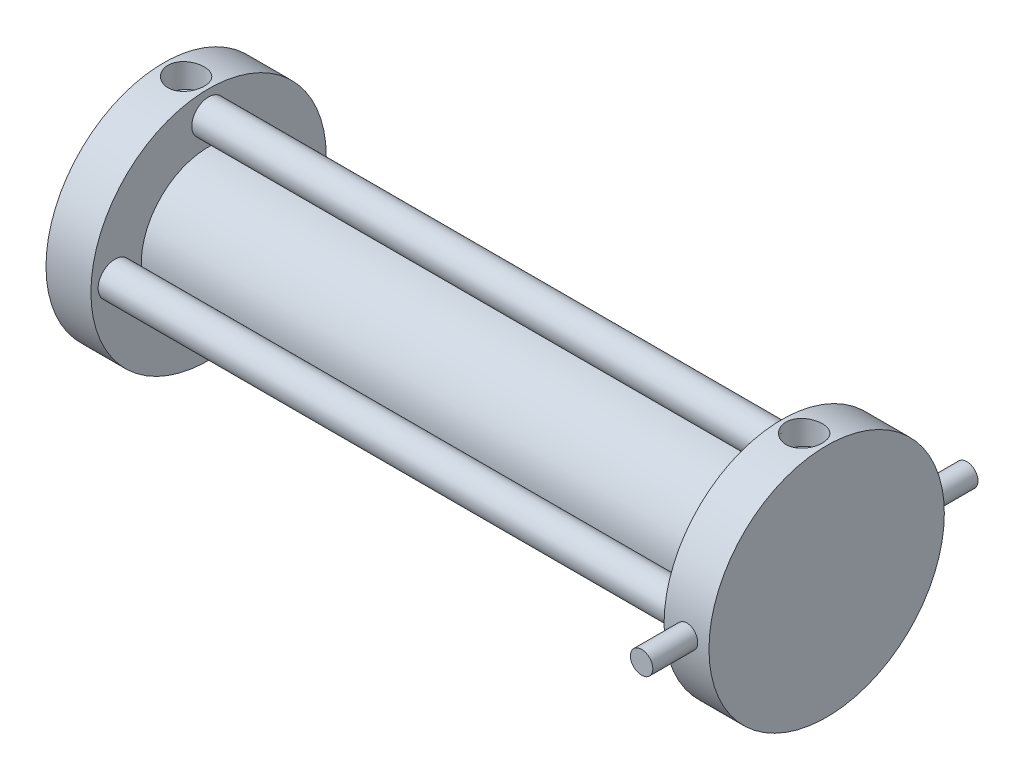
ISO-10303-21;
HEADER;
FILE_DESCRIPTION(('STEP AP214'),'2;1');
FILE_NAME('part.step','',(''),(''),'','','');
FILE_SCHEMA(('AUTOMOTIVE_DESIGN { 1 0 10303 214 1 1 1 1 }'));
ENDSEC;
DATA;
#1=APPLICATION_CONTEXT('core data for automotive mechanical design processes');
#2=APPLICATION_PROTOCOL_DEFINITION('international standard','automotive_design',2000,#1);
#3=PRODUCT_CONTEXT('',#1,'mechanical');
#4=PRODUCT('Part','Part','',(#3));
#5=PRODUCT_RELATED_PRODUCT_CATEGORY('part','',(#4));
#6=PRODUCT_DEFINITION_FORMATION('','',#4);
#7=PRODUCT_DEFINITION_CONTEXT('part definition',#1,'design');
#8=PRODUCT_DEFINITION('design','',#6,#7);
#9=PRODUCT_DEFINITION_SHAPE('','',#8);
#10=(LENGTH_UNIT() NAMED_UNIT(*) SI_UNIT(.MILLI.,.METRE.));
#11=(NAMED_UNIT(*) PLANE_ANGLE_UNIT() SI_UNIT($,.RADIAN.));
#12=(NAMED_UNIT(*) SI_UNIT($,.STERADIAN.) SOLID_ANGLE_UNIT());
#13=UNCERTAINTY_MEASURE_WITH_UNIT(LENGTH_MEASURE(1.E-05),#10,'distance_accuracy_value','');
#14=(GEOMETRIC_REPRESENTATION_CONTEXT(3) GLOBAL_UNCERTAINTY_ASSIGNED_CONTEXT((#13)) GLOBAL_UNIT_ASSIGNED_CONTEXT((#10,
#11,#12)) REPRESENTATION_CONTEXT('',''));
#15=CARTESIAN_POINT('',(0.,0.,0.));
#16=DIRECTION('',(0.,0.,1.));
#17=DIRECTION('',(1.,0.,0.));
#18=AXIS2_PLACEMENT_3D('',#15,#16,#17);
#19=CARTESIAN_POINT('',(187.452,0.,0.));
#20=DIRECTION('',(-1.,0.,0.));
#21=DIRECTION('',(0.,0.,1.));
#22=AXIS2_PLACEMENT_3D('',#19,#20,#21);
#23=CYLINDRICAL_SURFACE('',#22,33.274);
#24=CARTESIAN_POINT('',(177.563200178994,33.0652566163438,-3.72127409570066));
#25=CARTESIAN_POINT('',(177.772629469487,33.0429482318039,-3.91949732838269));
#26=CARTESIAN_POINT('',(177.998915602869,33.0208072454176,-4.1001718860428));
#27=CARTESIAN_POINT('',(178.478907105523,32.9793565679599,-4.42125292931893));
#28=CARTESIAN_POINT('',(178.732638283215,32.9600495828081,-4.56162105081854));
#29=CARTESIAN_POINT('',(179.260345097927,32.9264818691753,-4.79793434583255));
#30=CARTESIAN_POINT('',(179.534320128977,32.9122209897206,-4.8938808484182));
#31=CARTESIAN_POINT('',(180.094669829727,32.8903975618722,-5.03847515472606));
#32=CARTESIAN_POINT('',(180.381041304099,32.8828332980045,-5.08713507217993));
#33=CARTESIAN_POINT('',(180.956033608298,32.8753054758383,-5.13555972281086));
#34=CARTESIAN_POINT('',(181.244626104385,32.875290831484,-5.13565309158396));
#35=CARTESIAN_POINT('',(181.817698727291,32.8827356794035,-5.08776383433134));
#36=CARTESIAN_POINT('',(182.102178787033,32.8901952934502,-5.03978042502448));
#37=CARTESIAN_POINT('',(182.657916967103,32.9116892350749,-4.8974373434176));
#38=CARTESIAN_POINT('',(182.929219075785,32.9256997517771,-4.80324556634604));
#39=CARTESIAN_POINT('',(183.452183041596,32.9587017661262,-4.5712912597611));
#40=CARTESIAN_POINT('',(183.703843878541,32.9776935222801,-4.43352646890016));
#41=CARTESIAN_POINT('',(184.182508386549,33.0186999957293,-4.11704934659531));
#42=CARTESIAN_POINT('',(184.40930535564,33.0407370474255,-3.93802727557339));
#43=CARTESIAN_POINT('',(184.829733127168,33.0852556517351,-3.54457879361774));
#44=CARTESIAN_POINT('',(185.023362507949,33.1077372233558,-3.33015086586322));
#45=CARTESIAN_POINT('',(185.373067349896,33.1507681573595,-2.87039502918819));
#46=CARTESIAN_POINT('',(185.52891626289,33.1713054341931,-2.62489352876049));
#47=CARTESIAN_POINT('',(185.797027102362,33.2079771702855,-2.11083713814493));
#48=CARTESIAN_POINT('',(185.90929118331,33.2241118471604,-1.84228338826944));
#49=CARTESIAN_POINT('',(186.086180866149,33.2500472787563,-1.29179979636255));
#50=CARTESIAN_POINT('',(186.151149812872,33.259893618967,-1.00998250043332));
#51=CARTESIAN_POINT('',(186.23276982711,33.2723235697957,-0.439286266318469));
#52=CARTESIAN_POINT('',(186.249424665865,33.2749077472736,-0.150407881073319));
#53=CARTESIAN_POINT('',(186.233990471097,33.2725351781281,0.422720472249694));
#54=CARTESIAN_POINT('',(186.202451673477,33.2676635548133,0.70698579309776));
#55=CARTESIAN_POINT('',(186.092618586443,33.2510793359444,1.26612044808062));
#56=CARTESIAN_POINT('',(186.014324151405,33.2393667190834,1.5409897529479));
#57=CARTESIAN_POINT('',(185.813264347636,33.2103841321508,2.07382918189039));
#58=CARTESIAN_POINT('',(185.690469522959,33.1931104819364,2.33178797859826));
#59=CARTESIAN_POINT('',(185.403966706969,33.1548993703004,2.82358714670083));
#60=CARTESIAN_POINT('',(185.24025575415,33.1339616437059,3.05742577054721));
#61=CARTESIAN_POINT('',(184.874345147627,33.0904463358323,3.49727485660346));
#62=CARTESIAN_POINT('',(184.671718225071,33.0678524556106,3.70292833255674));
#63=CARTESIAN_POINT('',(184.234862704382,33.023757301146,4.07752305639828));
#64=CARTESIAN_POINT('',(184.00063275849,33.0022560735549,4.24646273776794));
#65=CARTESIAN_POINT('',(183.505402878859,32.9626269090273,4.54390239641229));
#66=CARTESIAN_POINT('',(183.244239137354,32.9445217605824,4.6721329186286));
#67=CARTESIAN_POINT('',(182.703778435218,32.9139422571387,4.88291921877905));
#68=CARTESIAN_POINT('',(182.424482385617,32.9014676194936,4.96547728947409));
#69=CARTESIAN_POINT('',(181.857610880513,32.8836609843559,5.08206759480338));
#70=CARTESIAN_POINT('',(181.570101080881,32.8782830636215,5.11641191655742));
#71=CARTESIAN_POINT('',(180.993352723585,32.8751454468966,5.13653611388134));
#72=CARTESIAN_POINT('',(180.704114246809,32.8773853971928,5.12231824429263));
#73=CARTESIAN_POINT('',(180.13430669021,32.8891781938294,5.04603550934228));
#74=CARTESIAN_POINT('',(179.853690199183,32.8986782945657,4.98431572654214));
#75=CARTESIAN_POINT('',(179.30684240825,32.9238436536572,4.81527143303873));
#76=CARTESIAN_POINT('',(179.040611581966,32.939509114855,4.70794542186506));
#77=CARTESIAN_POINT('',(178.528736902567,32.9753220310975,4.45018422472754));
#78=CARTESIAN_POINT('',(178.283190928272,32.9954893088488,4.29955750275382));
#79=CARTESIAN_POINT('',(177.820749188612,33.0380078983485,3.95959200744943));
#80=CARTESIAN_POINT('',(177.603855213005,33.0603593463803,3.7702508176859));
#81=CARTESIAN_POINT('',(177.202960569154,33.1049585080353,3.35625033672982));
#82=CARTESIAN_POINT('',(177.019256928372,33.127203701656,3.13130297476403));
#83=CARTESIAN_POINT('',(176.692275961426,33.1688934546782,2.65348793488495));
#84=CARTESIAN_POINT('',(176.54899806619,33.1883380535016,2.40062065006977));
#85=CARTESIAN_POINT('',(176.307401371888,33.2221860795681,1.87472603151846));
#86=CARTESIAN_POINT('',(176.208965995096,33.2366025553304,1.6017531403506));
#87=CARTESIAN_POINT('',(176.059520131785,33.2588277114233,1.04287493755571));
#88=CARTESIAN_POINT('',(176.008504259815,33.2666371421098,0.756971098370351));
#89=CARTESIAN_POINT('',(175.955804800355,33.2747094724556,0.18404259978819));
#90=CARTESIAN_POINT('',(175.953532437448,33.2750624383546,-0.102926751439129));
#91=CARTESIAN_POINT('',(175.996896329944,33.2684117092695,-0.673186878491167));
#92=CARTESIAN_POINT('',(176.042540208955,33.2614068436336,-0.956477061689066));
#93=CARTESIAN_POINT('',(176.180027131985,33.2408682571658,-1.51004094950111));
#94=CARTESIAN_POINT('',(176.271672313133,33.2273625083538,-1.78036501472752));
#95=CARTESIAN_POINT('',(176.498304857338,33.1953247221461,-2.30165963010028));
#96=CARTESIAN_POINT('',(176.633254722171,33.1767970354753,-2.55264669214384));
#97=CARTESIAN_POINT('',(176.898173250334,33.1424893757649,-2.96034759194169));
#98=CARTESIAN_POINT('',(177.018505062127,33.1274415606746,-3.12347803861945));
#99=CARTESIAN_POINT('',(177.27752313852,33.0966538901068,-3.43437875792502));
#100=CARTESIAN_POINT('',(177.416209732627,33.0809140222087,-3.58214875471523));
#101=CARTESIAN_POINT('',(177.563200178994,33.0652566163438,-3.72127409570066));
#102=B_SPLINE_CURVE_WITH_KNOTS('',3,(#24,#25,#26,#27,#28,#29,#30,#31,#32,#33,#34,#35,#36,#37,
#38,#39,#40,#41,#42,#43,#44,#45,#46,#47,#48,#49,#50,#51,#52,#53,#54,#55,#56,#57,#58,#59,#60,#61,
#62,#63,#64,#65,#66,#67,#68,#69,#70,#71,#72,#73,#74,#75,#76,#77,#78,#79,#80,#81,#82,#83,#84,#85,
#86,#87,#88,#89,#90,#91,#92,#93,#94,#95,#96,#97,#98,#99,#100,#101),.UNSPECIFIED.,.T.,.F.,(4,2,2,
2,2,2,2,2,2,2,2,2,2,2,2,2,2,2,2,2,2,2,2,2,2,2,2,2,2,2,2,2,2,2,2,2,2,2,4),(0.,0.866942832459273,
1.7347081161559,2.60244743509756,3.46996440060784,4.33161105626584,5.19327175035527,
6.05182458624455,6.91042198652903,7.77568835329061,8.6409917985141,9.51136229422175,
10.3816897605957,11.2456341954478,12.1095111918348,12.9635985722587,13.8176886128253,
14.6723450331543,15.5270633313925,16.3917660873086,17.2565057314606,18.1268552158963,
18.9971610047493,19.861806921654,20.7264126918345,21.5847960509608,22.4432076535664,
23.3054763659793,24.1677989148768,25.0374927711507,25.9071743841445,26.7745819871183,
27.6418910662064,28.4987178949009,29.3556810678069,30.2089894186347,31.0615608609272,
31.6700241072523,32.2784982782605),.UNSPECIFIED.);
#103=CARTESIAN_POINT('',(177.563200178994,33.0652566163438,-3.72127409570066));
#104=VERTEX_POINT('',#103);
#105=EDGE_CURVE('E11',#104,#104,#102,.T.);
#106=ORIENTED_EDGE('',*,*,#105,.T.);
#107=EDGE_LOOP('',(#106));
#108=FACE_BOUND('',#107,.T.);
#109=CARTESIAN_POINT('',(187.452,0.,0.));
#110=DIRECTION('',(1.,0.,0.));
#111=DIRECTION('',(0.,0.,-1.));
#112=AXIS2_PLACEMENT_3D('',#109,#110,#111);
#113=CIRCLE('',#112,33.274);
#114=CARTESIAN_POINT('',(187.452,0.,-33.274));
#115=VERTEX_POINT('',#114);
#116=EDGE_CURVE('E85',#115,#115,#113,.T.);
#117=ORIENTED_EDGE('',*,*,#116,.F.);
#118=EDGE_LOOP('',(#117));
#119=FACE_BOUND('',#118,.T.);
#120=CARTESIAN_POINT('',(174.752,0.,0.));
#121=DIRECTION('',(1.,0.,0.));
#122=DIRECTION('',(0.,0.,-1.));
#123=AXIS2_PLACEMENT_3D('',#120,#121,#122);
#124=CIRCLE('',#123,33.274);
#125=CARTESIAN_POINT('',(174.752,0.,-33.274));
#126=VERTEX_POINT('',#125);
#127=EDGE_CURVE('E89',#126,#126,#124,.T.);
#128=ORIENTED_EDGE('',*,*,#127,.T.);
#129=EDGE_LOOP('',(#128));
#130=FACE_BOUND('',#129,.T.);
#131=CARTESIAN_POINT('',(184.277,0.,-33.274));
#132=CARTESIAN_POINT('',(184.276992275536,-0.177907124340107,-33.2739980372501));
#133=CARTESIAN_POINT('',(184.261996466603,-0.355932894286446,-33.2725579918988));
#134=CARTESIAN_POINT('',(184.202399981999,-0.707051780438678,-33.2669518332966));
#135=CARTESIAN_POINT('',(184.157766419394,-0.88013919412405,-33.2627826918324));
#136=CARTESIAN_POINT('',(184.04020306018,-1.21624576665685,-33.2521891122648));
#137=CARTESIAN_POINT('',(183.967290038102,-1.37927082786577,-33.2457660113576));
#138=CARTESIAN_POINT('',(183.795269325636,-1.69073207092453,-33.2313833422953));
#139=CARTESIAN_POINT('',(183.696166959255,-1.8391712095283,-33.2234240865121));
#140=CARTESIAN_POINT('',(183.474230075501,-2.11777215026191,-33.2068318486525));
#141=CARTESIAN_POINT('',(183.351327000368,-2.24787923020528,-33.1981969643182));
#142=CARTESIAN_POINT('',(183.085423370726,-2.48565267484645,-33.1812424709576));
#143=CARTESIAN_POINT('',(182.942421901134,-2.59331801721262,-33.1729228763084));
#144=CARTESIAN_POINT('',(182.640041185058,-2.78334333417336,-33.1575212416076));
#145=CARTESIAN_POINT('',(182.480630921697,-2.86565416517198,-33.1504416162474));
#146=CARTESIAN_POINT('',(182.150173073411,-3.00232013346033,-33.1383446274974));
#147=CARTESIAN_POINT('',(181.979125751984,-3.0566759034975,-33.1333272174311));
#148=CARTESIAN_POINT('',(181.630804805187,-3.13572747234196,-33.1259396389373));
#149=CARTESIAN_POINT('',(181.453551859092,-3.16051362316257,-33.1235614078789));
#150=CARTESIAN_POINT('',(181.09738698304,-3.18000161141323,-33.1216963138693));
#151=CARTESIAN_POINT('',(180.918475093133,-3.17470417323843,-33.1222093812974));
#152=CARTESIAN_POINT('',(180.564692735505,-3.13424988564366,-33.1260615603491));
#153=CARTESIAN_POINT('',(180.389810886765,-3.09919155345526,-33.1293913476815));
#154=CARTESIAN_POINT('',(180.048424818341,-3.000363877468,-33.138487202879));
#155=CARTESIAN_POINT('',(179.881920702721,-2.93659417713178,-33.1442533009983));
#156=CARTESIAN_POINT('',(179.561704524925,-2.78204475203505,-33.1575828177338));
#157=CARTESIAN_POINT('',(179.408013753996,-2.6912211747548,-33.1651491503712));
#158=CARTESIAN_POINT('',(179.118019923055,-2.48517368338236,-33.1812240760424));
#159=CARTESIAN_POINT('',(178.98171732627,-2.36994911945569,-33.1897326941678));
#160=CARTESIAN_POINT('',(178.729796392874,-2.11781953730284,-33.2067750184677));
#161=CARTESIAN_POINT('',(178.614263214673,-1.98082941157619,-33.2153086883808));
#162=CARTESIAN_POINT('',(178.407820250812,-1.68935328541947,-33.2314072800177));
#163=CARTESIAN_POINT('',(178.31691048915,-1.53486726793723,-33.2389722007974));
#164=CARTESIAN_POINT('',(178.162298920409,-1.21272671516573,-33.2522830986424));
#165=CARTESIAN_POINT('',(178.098601273279,-1.04507017111637,-33.2580287975663));
#166=CARTESIAN_POINT('',(178.000283669981,-0.701374830615911,-33.2670509382834));
#167=CARTESIAN_POINT('',(177.965662922275,-0.525336262479929,-33.2703274472932));
#168=CARTESIAN_POINT('',(177.926589537273,-0.170611631070878,-33.2740334036665));
#169=CARTESIAN_POINT('',(177.922019354491,0.00806137338843605,-33.2744739440342));
#170=CARTESIAN_POINT('',(177.942868334598,0.363630851009317,-33.2724880368889));
#171=CARTESIAN_POINT('',(177.968287129179,0.54052734596211,-33.2700616245865));
#172=CARTESIAN_POINT('',(178.048295026917,0.887184295588675,-33.2626216484045));
#173=CARTESIAN_POINT('',(178.102829254509,1.05695752875408,-33.257612952115));
#174=CARTESIAN_POINT('',(178.239463699063,1.38494552049296,-33.2455705318801));
#175=CARTESIAN_POINT('',(178.321564481382,1.54316004192973,-33.2385367664032));
#176=CARTESIAN_POINT('',(178.511294143897,1.84407195913702,-33.223203835135));
#177=CARTESIAN_POINT('',(178.619000441385,1.98672034488491,-33.2149008596575));
#178=CARTESIAN_POINT('',(178.85677250248,2.25195502670129,-33.1979739095776));
#179=CARTESIAN_POINT('',(178.986838776351,2.37454086480964,-33.1893499276531));
#180=CARTESIAN_POINT('',(179.266150757099,2.59657738201941,-33.1727197187131));
#181=CARTESIAN_POINT('',(179.415457831805,2.69595104367235,-33.1647156055115));
#182=CARTESIAN_POINT('',(179.728709639966,2.86821330501682,-33.1502629373211));
#183=CARTESIAN_POINT('',(179.892654188814,2.94110223867685,-33.1438143627175));
#184=CARTESIAN_POINT('',(180.230260524633,3.05819639666525,-33.1332157443536));
#185=CARTESIAN_POINT('',(180.403906162807,3.10244783240111,-33.129061999094));
#186=CARTESIAN_POINT('',(180.756204479817,3.16116095244913,-33.1235116041131));
#187=CARTESIAN_POINT('',(180.934857028903,3.17562340798656,-33.1221148830135));
#188=CARTESIAN_POINT('',(181.29133242321,3.17433786217606,-33.1222380527875));
#189=CARTESIAN_POINT('',(181.469155721209,3.15871085116628,-33.1237462628831));
#190=CARTESIAN_POINT('',(181.819638994173,3.09794324071722,-33.1294844781342));
#191=CARTESIAN_POINT('',(181.992298962665,3.05280260428121,-33.1337144867015));
#192=CARTESIAN_POINT('',(182.327555997853,2.93432172933284,-33.1444164934302));
#193=CARTESIAN_POINT('',(182.490154190624,2.86098465310968,-33.1508882401679));
#194=CARTESIAN_POINT('',(182.800751999884,2.68820539328413,-33.165345020468));
#195=CARTESIAN_POINT('',(182.948751741022,2.5887634326039,-33.1733300411077));
#196=CARTESIAN_POINT('',(183.226571462403,2.36614246875153,-33.1899520614515));
#197=CARTESIAN_POINT('',(183.356319143105,2.24287341671968,-33.1985914563928));
#198=CARTESIAN_POINT('',(183.593342972736,1.97627235961269,-33.2155268687063));
#199=CARTESIAN_POINT('',(183.700613716075,1.83293554213696,-33.2238228030939));
#200=CARTESIAN_POINT('',(183.889830520731,1.52990830082979,-33.2391562554373));
#201=CARTESIAN_POINT('',(183.971717179526,1.37018066445449,-33.2461908056046));
#202=CARTESIAN_POINT('',(184.107399937665,1.03927964402342,-33.258176008054));
#203=CARTESIAN_POINT('',(184.16122789047,0.868119488887997,-33.2631290221425));
#204=CARTESIAN_POINT('',(184.22575891962,0.579981838385046,-33.2691406226303));
#205=CARTESIAN_POINT('',(184.244948280615,0.464849653374439,-33.2709544509832));
#206=CARTESIAN_POINT('',(184.270571328818,0.233161965251499,-33.273384780696));
#207=CARTESIAN_POINT('',(184.27700506288,0.116606467368922,-33.274001286454));
#208=CARTESIAN_POINT('',(184.277,0.,-33.274));
#209=B_SPLINE_CURVE_WITH_KNOTS('',3,(#131,#132,#133,#134,#135,#136,#137,#138,#139,#140,#141,
#142,#143,#144,#145,#146,#147,#148,#149,#150,#151,#152,#153,#154,#155,#156,#157,#158,#159,#160,
#161,#162,#163,#164,#165,#166,#167,#168,#169,#170,#171,#172,#173,#174,#175,#176,#177,#178,#179,
#180,#181,#182,#183,#184,#185,#186,#187,#188,#189,#190,#191,#192,#193,#194,#195,#196,#197,#198,
#199,#200,#201,#202,#203,#204,#205,#206,#207,#208),.UNSPECIFIED.,.T.,.F.,(4,2,2,2,2,2,2,2,2,2,2,
2,2,2,2,2,2,2,2,2,2,2,2,2,2,2,2,2,2,2,2,2,2,2,2,2,2,2,4),(0.,0.533295588202124,1.06718392815617,
1.60075606463727,2.13421981508282,2.66924369588392,3.20429194433251,3.74037082209694,
4.2764375654765,4.81086208991797,5.34527374578524,5.87792321101528,6.41057929086128,
6.94410351286507,7.47764194519764,8.01332042447372,8.54899942584708,9.08476028785062,
9.62050656478453,10.1541559689533,10.687798819195,11.2204394138349,11.7530909329784,
12.2873738572025,12.8216689755989,13.3577124595402,13.8937491838176,14.4289187517286,
14.9640744641306,15.4970827979489,16.0300917999196,16.5630410412541,17.0959857316265,
17.6309853964036,18.1661135785683,18.7024847478259,19.2382456718017,19.5877872838017,
19.9373276118484),.UNSPECIFIED.);
#210=CARTESIAN_POINT('',(184.277,0.,-33.274));
#211=VERTEX_POINT('',#210);
#212=EDGE_CURVE('E126',#211,#211,#209,.T.);
#213=ORIENTED_EDGE('',*,*,#212,.F.);
#214=EDGE_LOOP('',(#213));
#215=FACE_BOUND('',#214,.T.);
#216=CARTESIAN_POINT('',(184.277,0.,33.274));
#217=CARTESIAN_POINT('',(184.276992275536,0.177907124340107,33.2739980372501));
#218=CARTESIAN_POINT('',(184.261996466603,0.355932894286446,33.2725579918988));
#219=CARTESIAN_POINT('',(184.202399981999,0.707051780438678,33.2669518332966));
#220=CARTESIAN_POINT('',(184.157766419394,0.88013919412405,33.2627826918324));
#221=CARTESIAN_POINT('',(184.04020306018,1.21624576665685,33.2521891122648));
#222=CARTESIAN_POINT('',(183.967290038102,1.37927082786577,33.2457660113576));
#223=CARTESIAN_POINT('',(183.795269325636,1.69073207092453,33.2313833422953));
#224=CARTESIAN_POINT('',(183.696166959255,1.8391712095283,33.2234240865121));
#225=CARTESIAN_POINT('',(183.474230075501,2.11777215026191,33.2068318486525));
#226=CARTESIAN_POINT('',(183.351327000368,2.24787923020528,33.1981969643182));
#227=CARTESIAN_POINT('',(183.085423370726,2.48565267484645,33.1812424709576));
#228=CARTESIAN_POINT('',(182.942421901134,2.59331801721262,33.1729228763084));
#229=CARTESIAN_POINT('',(182.640041185058,2.78334333417336,33.1575212416076));
#230=CARTESIAN_POINT('',(182.480630921697,2.86565416517198,33.1504416162474));
#231=CARTESIAN_POINT('',(182.150173073411,3.00232013346033,33.1383446274974));
#232=CARTESIAN_POINT('',(181.979125751984,3.0566759034975,33.1333272174311));
#233=CARTESIAN_POINT('',(181.630804805187,3.13572747234196,33.1259396389373));
#234=CARTESIAN_POINT('',(181.453551859092,3.16051362316257,33.1235614078789));
#235=CARTESIAN_POINT('',(181.09738698304,3.18000161141323,33.1216963138693));
#236=CARTESIAN_POINT('',(180.918475093133,3.17470417323843,33.1222093812974));
#237=CARTESIAN_POINT('',(180.564692735505,3.13424988564366,33.1260615603491));
#238=CARTESIAN_POINT('',(180.389810886765,3.09919155345526,33.1293913476815));
#239=CARTESIAN_POINT('',(180.048424818341,3.000363877468,33.138487202879));
#240=CARTESIAN_POINT('',(179.881920702721,2.93659417713178,33.1442533009983));
#241=CARTESIAN_POINT('',(179.561704524925,2.78204475203505,33.1575828177338));
#242=CARTESIAN_POINT('',(179.408013753996,2.6912211747548,33.1651491503712));
#243=CARTESIAN_POINT('',(179.118019923055,2.48517368338236,33.1812240760424));
#244=CARTESIAN_POINT('',(178.98171732627,2.36994911945569,33.1897326941678));
#245=CARTESIAN_POINT('',(178.729796392874,2.11781953730284,33.2067750184677));
#246=CARTESIAN_POINT('',(178.614263214673,1.98082941157619,33.2153086883808));
#247=CARTESIAN_POINT('',(178.407820250812,1.68935328541947,33.2314072800177));
#248=CARTESIAN_POINT('',(178.31691048915,1.53486726793723,33.2389722007974));
#249=CARTESIAN_POINT('',(178.162298920409,1.21272671516573,33.2522830986424));
#250=CARTESIAN_POINT('',(178.098601273279,1.04507017111637,33.2580287975663));
#251=CARTESIAN_POINT('',(178.000283669981,0.701374830615911,33.2670509382834));
#252=CARTESIAN_POINT('',(177.965662922275,0.525336262479929,33.2703274472932));
#253=CARTESIAN_POINT('',(177.926589537273,0.170611631070878,33.2740334036665));
#254=CARTESIAN_POINT('',(177.922019354491,-0.00806137338843605,33.2744739440342));
#255=CARTESIAN_POINT('',(177.942868334598,-0.363630851009317,33.2724880368889));
#256=CARTESIAN_POINT('',(177.968287129179,-0.54052734596211,33.2700616245865));
#257=CARTESIAN_POINT('',(178.048295026917,-0.887184295588675,33.2626216484045));
#258=CARTESIAN_POINT('',(178.102829254509,-1.05695752875408,33.257612952115));
#259=CARTESIAN_POINT('',(178.239463699063,-1.38494552049296,33.2455705318801));
#260=CARTESIAN_POINT('',(178.321564481382,-1.54316004192973,33.2385367664032));
#261=CARTESIAN_POINT('',(178.511294143897,-1.84407195913702,33.223203835135));
#262=CARTESIAN_POINT('',(178.619000441385,-1.98672034488491,33.2149008596575));
#263=CARTESIAN_POINT('',(178.85677250248,-2.25195502670129,33.1979739095776));
#264=CARTESIAN_POINT('',(178.986838776351,-2.37454086480964,33.1893499276531));
#265=CARTESIAN_POINT('',(179.266150757099,-2.59657738201941,33.1727197187131));
#266=CARTESIAN_POINT('',(179.415457831805,-2.69595104367235,33.1647156055115));
#267=CARTESIAN_POINT('',(179.728709639966,-2.86821330501682,33.1502629373211));
#268=CARTESIAN_POINT('',(179.892654188814,-2.94110223867685,33.1438143627175));
#269=CARTESIAN_POINT('',(180.230260524633,-3.05819639666525,33.1332157443536));
#270=CARTESIAN_POINT('',(180.403906162807,-3.10244783240111,33.129061999094));
#271=CARTESIAN_POINT('',(180.756204479817,-3.16116095244913,33.1235116041131));
#272=CARTESIAN_POINT('',(180.934857028903,-3.17562340798656,33.1221148830135));
#273=CARTESIAN_POINT('',(181.29133242321,-3.17433786217606,33.1222380527875));
#274=CARTESIAN_POINT('',(181.469155721209,-3.15871085116628,33.1237462628831));
#275=CARTESIAN_POINT('',(181.819638994173,-3.09794324071722,33.1294844781342));
#276=CARTESIAN_POINT('',(181.992298962665,-3.05280260428121,33.1337144867015));
#277=CARTESIAN_POINT('',(182.327555997853,-2.93432172933284,33.1444164934302));
#278=CARTESIAN_POINT('',(182.490154190624,-2.86098465310968,33.1508882401679));
#279=CARTESIAN_POINT('',(182.800751999884,-2.68820539328413,33.165345020468));
#280=CARTESIAN_POINT('',(182.948751741022,-2.5887634326039,33.1733300411077));
#281=CARTESIAN_POINT('',(183.226571462403,-2.36614246875153,33.1899520614515));
#282=CARTESIAN_POINT('',(183.356319143105,-2.24287341671968,33.1985914563928));
#283=CARTESIAN_POINT('',(183.593342972736,-1.97627235961269,33.2155268687063));
#284=CARTESIAN_POINT('',(183.700613716075,-1.83293554213696,33.2238228030939));
#285=CARTESIAN_POINT('',(183.889830520731,-1.52990830082979,33.2391562554373));
#286=CARTESIAN_POINT('',(183.971717179526,-1.37018066445449,33.2461908056046));
#287=CARTESIAN_POINT('',(184.107399937665,-1.03927964402342,33.258176008054));
#288=CARTESIAN_POINT('',(184.16122789047,-0.868119488887997,33.2631290221425));
#289=CARTESIAN_POINT('',(184.22575891962,-0.579981838385046,33.2691406226303));
#290=CARTESIAN_POINT('',(184.244948280615,-0.464849653374439,33.2709544509832));
#291=CARTESIAN_POINT('',(184.270571328818,-0.233161965251499,33.273384780696));
#292=CARTESIAN_POINT('',(184.27700506288,-0.116606467368922,33.274001286454));
#293=CARTESIAN_POINT('',(184.277,0.,33.274));
#294=B_SPLINE_CURVE_WITH_KNOTS('',3,(#216,#217,#218,#219,#220,#221,#222,#223,#224,#225,#226,
#227,#228,#229,#230,#231,#232,#233,#234,#235,#236,#237,#238,#239,#240,#241,#242,#243,#244,#245,
#246,#247,#248,#249,#250,#251,#252,#253,#254,#255,#256,#257,#258,#259,#260,#261,#262,#263,#264,
#265,#266,#267,#268,#269,#270,#271,#272,#273,#274,#275,#276,#277,#278,#279,#280,#281,#282,#283,
#284,#285,#286,#287,#288,#289,#290,#291,#292,#293),.UNSPECIFIED.,.T.,.F.,(4,2,2,2,2,2,2,2,2,2,2,
2,2,2,2,2,2,2,2,2,2,2,2,2,2,2,2,2,2,2,2,2,2,2,2,2,2,2,4),(0.,0.533295588202124,1.06718392815617,
1.60075606463727,2.13421981508282,2.66924369588392,3.20429194433251,3.74037082209694,
4.2764375654765,4.81086208991797,5.34527374578524,5.87792321101528,6.41057929086128,
6.94410351286507,7.47764194519764,8.01332042447372,8.54899942584708,9.08476028785062,
9.62050656478453,10.1541559689533,10.687798819195,11.2204394138349,11.7530909329784,
12.2873738572025,12.8216689755989,13.3577124595402,13.8937491838176,14.4289187517286,
14.9640744641306,15.4970827979489,16.0300917999196,16.5630410412541,17.0959857316265,
17.6309853964036,18.1661135785683,18.7024847478259,19.2382456718017,19.5877872838017,
19.9373276118484),.UNSPECIFIED.);
#295=CARTESIAN_POINT('',(184.277,0.,33.274));
#296=VERTEX_POINT('',#295);
#297=EDGE_CURVE('E133',#296,#296,#294,.T.);
#298=ORIENTED_EDGE('',*,*,#297,.F.);
#299=EDGE_LOOP('',(#298));
#300=FACE_BOUND('',#299,.T.);
#301=ADVANCED_FACE('F32',(#108,#119,#130,#215,#300),#23,.T.);
#302=CARTESIAN_POINT('',(12.7,0.,0.));
#303=DIRECTION('',(-1.,0.,0.));
#304=DIRECTION('',(0.,0.,1.));
#305=AXIS2_PLACEMENT_3D('',#302,#303,#304);
#306=CYLINDRICAL_SURFACE('',#305,33.274);
#307=CARTESIAN_POINT('',(2.81120017899396,33.0652566163438,-3.72127409570066));
#308=CARTESIAN_POINT('',(3.02062946948686,33.0429482318039,-3.91949732838269));
#309=CARTESIAN_POINT('',(3.24691560286942,33.0208072454176,-4.1001718860428));
#310=CARTESIAN_POINT('',(3.72690710552271,32.9793565679599,-4.42125292931892));
#311=CARTESIAN_POINT('',(3.98063828321526,32.9600495828081,-4.56162105081854));
#312=CARTESIAN_POINT('',(4.50834509792725,32.9264818691753,-4.79793434583255));
#313=CARTESIAN_POINT('',(4.7823201289769,32.9122209897206,-4.8938808484182));
#314=CARTESIAN_POINT('',(5.34266982972733,32.8903975618722,-5.03847515472606));
#315=CARTESIAN_POINT('',(5.62904130409932,32.8828332980045,-5.08713507217993));
#316=CARTESIAN_POINT('',(6.20403360829848,32.8753054758383,-5.13555972281086));
#317=CARTESIAN_POINT('',(6.49262610438488,32.875290831484,-5.13565309158397));
#318=CARTESIAN_POINT('',(7.06569872729101,32.8827356794035,-5.08776383433135));
#319=CARTESIAN_POINT('',(7.35017878703311,32.8901952934502,-5.03978042502448));
#320=CARTESIAN_POINT('',(7.90591696710349,32.9116892350749,-4.89743734341761));
#321=CARTESIAN_POINT('',(8.17721907578454,32.9256997517771,-4.80324556634606));
#322=CARTESIAN_POINT('',(8.70018304159638,32.9587017661262,-4.57129125976111));
#323=CARTESIAN_POINT('',(8.95184387854127,32.9776935222801,-4.43352646890017));
#324=CARTESIAN_POINT('',(9.43050838654938,33.0186999957292,-4.11704934659532));
#325=CARTESIAN_POINT('',(9.65730535564013,33.0407370474255,-3.9380272755734));
#326=CARTESIAN_POINT('',(10.0777331271676,33.0852556517351,-3.54457879361775));
#327=CARTESIAN_POINT('',(10.2713625079487,33.1077372233558,-3.33015086586323));
#328=CARTESIAN_POINT('',(10.6210673498962,33.1507681573595,-2.8703950291882));
#329=CARTESIAN_POINT('',(10.77691626289,33.1713054341931,-2.6248935287605));
#330=CARTESIAN_POINT('',(11.0450271023615,33.2079771702855,-2.11083713814493));
#331=CARTESIAN_POINT('',(11.1572911833097,33.2241118471604,-1.84228338826944));
#332=CARTESIAN_POINT('',(11.3341808661493,33.2500472787563,-1.29179979636255));
#333=CARTESIAN_POINT('',(11.3991498128716,33.259893618967,-1.00998250043332));
#334=CARTESIAN_POINT('',(11.4807698271096,33.2723235697957,-0.439286266318475));
#335=CARTESIAN_POINT('',(11.497424665865,33.2749077472736,-0.150407881073329));
#336=CARTESIAN_POINT('',(11.4819904710969,33.2725351781281,0.422720472249682));
#337=CARTESIAN_POINT('',(11.4504516734769,33.2676635548133,0.706985793097749));
#338=CARTESIAN_POINT('',(11.3406185864434,33.2510793359444,1.26612044808061));
#339=CARTESIAN_POINT('',(11.2623241514054,33.2393667190834,1.54098975294789));
#340=CARTESIAN_POINT('',(11.0612643476362,33.2103841321508,2.07382918189038));
#341=CARTESIAN_POINT('',(10.9384695229587,33.1931104819364,2.33178797859826));
#342=CARTESIAN_POINT('',(10.651966706969,33.1548993703004,2.82358714670083));
#343=CARTESIAN_POINT('',(10.4882557541496,33.1339616437059,3.05742577054721));
#344=CARTESIAN_POINT('',(10.1223451476272,33.0904463358323,3.49727485660345));
#345=CARTESIAN_POINT('',(9.91971822507097,33.0678524556106,3.70292833255673));
#346=CARTESIAN_POINT('',(9.48286270438187,33.023757301146,4.07752305639828));
#347=CARTESIAN_POINT('',(9.24863275848968,33.0022560735549,4.24646273776794));
#348=CARTESIAN_POINT('',(8.75340287885889,32.9626269090273,4.54390239641229));
#349=CARTESIAN_POINT('',(8.4922391373539,32.9445217605824,4.6721329186286));
#350=CARTESIAN_POINT('',(7.95177843521801,32.9139422571387,4.88291921877905));
#351=CARTESIAN_POINT('',(7.67248238561714,32.9014676194936,4.9654772894741));
#352=CARTESIAN_POINT('',(7.10561088051267,32.8836609843559,5.08206759480338));
#353=CARTESIAN_POINT('',(6.81810108088093,32.8782830636215,5.11641191655742));
#354=CARTESIAN_POINT('',(6.24135272358493,32.8751454468966,5.13653611388135));
#355=CARTESIAN_POINT('',(5.95211424680917,32.8773853971928,5.12231824429264));
#356=CARTESIAN_POINT('',(5.38230669020972,32.8891781938294,5.0460355093423));
#357=CARTESIAN_POINT('',(5.10169019918287,32.8986782945657,4.98431572654216));
#358=CARTESIAN_POINT('',(4.55484240825016,32.9238436536572,4.81527143303875));
#359=CARTESIAN_POINT('',(4.28861158196559,32.939509114855,4.70794542186506));
#360=CARTESIAN_POINT('',(3.77673690256699,32.9753220310975,4.45018422472755));
#361=CARTESIAN_POINT('',(3.53119092827166,32.9954893088488,4.29955750275384));
#362=CARTESIAN_POINT('',(3.06874918861212,33.0380078983485,3.95959200744945));
#363=CARTESIAN_POINT('',(2.85185521300541,33.0603593463803,3.77025081768593));
#364=CARTESIAN_POINT('',(2.45096056915448,33.1049585080353,3.35625033672985));
#365=CARTESIAN_POINT('',(2.2672569283717,33.127203701656,3.13130297476407));
#366=CARTESIAN_POINT('',(1.94027596142578,33.1688934546782,2.65348793488498));
#367=CARTESIAN_POINT('',(1.79699806618995,33.1883380535016,2.4006206500698));
#368=CARTESIAN_POINT('',(1.55540137188837,33.2221860795681,1.87472603151849));
#369=CARTESIAN_POINT('',(1.45696599509557,33.2366025553304,1.60175314035062));
#370=CARTESIAN_POINT('',(1.30752013178549,33.2588277114233,1.04287493755573));
#371=CARTESIAN_POINT('',(1.25650425981517,33.2666371421098,0.756971098370372));
#372=CARTESIAN_POINT('',(1.20380480035468,33.2747094724556,0.184042599788207));
#373=CARTESIAN_POINT('',(1.20153243744799,33.2750624383546,-0.102926751439112));
#374=CARTESIAN_POINT('',(1.24489632994426,33.2684117092695,-0.673186878491152));
#375=CARTESIAN_POINT('',(1.29054020895547,33.2614068436336,-0.956477061689053));
#376=CARTESIAN_POINT('',(1.42802713198465,33.2408682571658,-1.5100409495011));
#377=CARTESIAN_POINT('',(1.51967231313346,33.2273625083538,-1.78036501472751));
#378=CARTESIAN_POINT('',(1.74630485733753,33.1953247221461,-2.30165963010027));
#379=CARTESIAN_POINT('',(1.88125472217127,33.1767970354753,-2.55264669214383));
#380=CARTESIAN_POINT('',(2.14617325033358,33.1424893757649,-2.96034759194168));
#381=CARTESIAN_POINT('',(2.26650506212718,33.1274415606746,-3.12347803861944));
#382=CARTESIAN_POINT('',(2.5255231385205,33.0966538901068,-3.43437875792501));
#383=CARTESIAN_POINT('',(2.66420973262735,33.0809140222087,-3.58214875471523));
#384=CARTESIAN_POINT('',(2.81120017899396,33.0652566163438,-3.72127409570066));
#385=B_SPLINE_CURVE_WITH_KNOTS('',3,(#307,#308,#309,#310,#311,#312,#313,#314,#315,#316,#317,
#318,#319,#320,#321,#322,#323,#324,#325,#326,#327,#328,#329,#330,#331,#332,#333,#334,#335,#336,
#337,#338,#339,#340,#341,#342,#343,#344,#345,#346,#347,#348,#349,#350,#351,#352,#353,#354,#355,
#356,#357,#358,#359,#360,#361,#362,#363,#364,#365,#366,#367,#368,#369,#370,#371,#372,#373,#374,
#375,#376,#377,#378,#379,#380,#381,#382,#383,#384),.UNSPECIFIED.,.T.,.F.,(4,2,2,2,2,2,2,2,2,2,2,
2,2,2,2,2,2,2,2,2,2,2,2,2,2,2,2,2,2,2,2,2,2,2,2,2,2,2,4),(0.,0.866942832459265,1.73470811615591,
2.60244743509759,3.46996440060785,4.33161105626588,5.19327175035529,6.05182458624457,
6.91042198652903,7.77568835329063,8.64099179851413,9.51136229422179,10.3816897605958,
11.2456341954478,12.1095111918348,12.9635985722588,13.8176886128253,14.6723450331543,
15.5270633313926,16.3917660873087,17.2565057314606,18.1268552158964,18.9971610047494,
19.861806921654,20.7264126918345,21.5847960509608,22.4432076535664,23.3054763659794,
24.1677989148768,25.0374927711508,25.9071743841446,26.7745819871183,27.6418910662064,
28.498717894901,29.355681067807,30.2089894186347,31.0615608609273,31.6700241072523,
32.2784982782605),.UNSPECIFIED.);
#386=CARTESIAN_POINT('',(2.81120017899396,33.0652566163438,-3.72127409570066));
#387=VERTEX_POINT('',#386);
#388=EDGE_CURVE('E46',#387,#387,#385,.T.);
#389=ORIENTED_EDGE('',*,*,#388,.T.);
#390=EDGE_LOOP('',(#389));
#391=FACE_BOUND('',#390,.T.);
#392=CARTESIAN_POINT('',(12.7,0.,0.));
#393=DIRECTION('',(1.,0.,0.));
#394=DIRECTION('',(0.,0.,-1.));
#395=AXIS2_PLACEMENT_3D('',#392,#393,#394);
#396=CIRCLE('',#395,33.274);
#397=CARTESIAN_POINT('',(12.7,0.,-33.274));
#398=VERTEX_POINT('',#397);
#399=EDGE_CURVE('E100',#398,#398,#396,.T.);
#400=ORIENTED_EDGE('',*,*,#399,.F.);
#401=EDGE_LOOP('',(#400));
#402=FACE_BOUND('',#401,.T.);
#403=CARTESIAN_POINT('',(0.,0.,0.));
#404=DIRECTION('',(1.,0.,0.));
#405=DIRECTION('',(0.,0.,-1.));
#406=AXIS2_PLACEMENT_3D('',#403,#404,#405);
#407=CIRCLE('',#406,33.274);
#408=CARTESIAN_POINT('',(0.,0.,-33.274));
#409=VERTEX_POINT('',#408);
#410=EDGE_CURVE('E95',#409,#409,#407,.T.);
#411=ORIENTED_EDGE('',*,*,#410,.T.);
#412=EDGE_LOOP('',(#411));
#413=FACE_BOUND('',#412,.T.);
#414=ADVANCED_FACE('F34',(#391,#402,#413),#306,.T.);
#415=CARTESIAN_POINT('',(12.7,0.,0.));
#416=DIRECTION('',(1.,0.,0.));
#417=DIRECTION('',(0.,0.,-1.));
#418=AXIS2_PLACEMENT_3D('',#415,#416,#417);
#419=PLANE('',#418);
#420=CARTESIAN_POINT('',(12.7,26.4795,-2.7735804033569E-13));
#421=DIRECTION('',(1.,0.,0.));
#422=DIRECTION('',(0.,0.,-1.));
#423=AXIS2_PLACEMENT_3D('',#420,#421,#422);
#424=CIRCLE('',#423,4.7625);
#425=CARTESIAN_POINT('',(12.7,26.4795,-4.76250000000028));
#426=VERTEX_POINT('',#425);
#427=EDGE_CURVE('E121',#426,#426,#424,.T.);
#428=ORIENTED_EDGE('',*,*,#427,.F.);
#429=EDGE_LOOP('',(#428));
#430=FACE_BOUND('',#429,.T.);
#431=CARTESIAN_POINT('',(12.7,1.84905360223793E-13,26.4795));
#432=DIRECTION('',(1.,0.,0.));
#433=DIRECTION('',(0.,0.,-1.));
#434=AXIS2_PLACEMENT_3D('',#431,#432,#433);
#435=CIRCLE('',#434,4.7625);
#436=CARTESIAN_POINT('',(12.7,1.84905360223793E-13,21.717));
#437=VERTEX_POINT('',#436);
#438=EDGE_CURVE('E116',#437,#437,#435,.T.);
#439=ORIENTED_EDGE('',*,*,#438,.F.);
#440=EDGE_LOOP('',(#439));
#441=FACE_BOUND('',#440,.T.);
#442=CARTESIAN_POINT('',(12.7,-26.4795,0.));
#443=DIRECTION('',(1.,0.,0.));
#444=DIRECTION('',(0.,0.,-1.));
#445=AXIS2_PLACEMENT_3D('',#442,#443,#444);
#446=CIRCLE('',#445,4.7625);
#447=CARTESIAN_POINT('',(12.7,-26.4795,-4.76249999999991));
#448=VERTEX_POINT('',#447);
#449=EDGE_CURVE('E110',#448,#448,#446,.T.);
#450=ORIENTED_EDGE('',*,*,#449,.F.);
#451=EDGE_LOOP('',(#450));
#452=FACE_BOUND('',#451,.T.);
#453=CARTESIAN_POINT('',(12.7,0.,-26.4795));
#454=DIRECTION('',(1.,0.,0.));
#455=DIRECTION('',(0.,0.,-1.));
#456=AXIS2_PLACEMENT_3D('',#453,#454,#455);
#457=CIRCLE('',#456,4.7625);
#458=CARTESIAN_POINT('',(12.7,0.,-31.242));
#459=VERTEX_POINT('',#458);
#460=EDGE_CURVE('E99',#459,#459,#457,.T.);
#461=ORIENTED_EDGE('',*,*,#460,.F.);
#462=EDGE_LOOP('',(#461));
#463=FACE_BOUND('',#462,.T.);
#464=CARTESIAN_POINT('',(12.7,0.,0.));
#465=DIRECTION('',(1.,0.,0.));
#466=DIRECTION('',(0.,0.,-1.));
#467=AXIS2_PLACEMENT_3D('',#464,#465,#466);
#468=CIRCLE('',#467,19.05);
#469=CARTESIAN_POINT('',(12.7,0.,-19.05));
#470=VERTEX_POINT('',#469);
#471=EDGE_CURVE('E96',#470,#470,#468,.T.);
#472=ORIENTED_EDGE('',*,*,#471,.F.);
#473=EDGE_LOOP('',(#472));
#474=FACE_BOUND('',#473,.T.);
#475=ORIENTED_EDGE('',*,*,#399,.T.);
#476=EDGE_LOOP('',(#475));
#477=FACE_BOUND('',#476,.T.);
#478=ADVANCED_FACE('F179',(#430,#441,#452,#463,#474,#477),#419,.T.);
#479=CARTESIAN_POINT('',(0.,0.,0.));
#480=DIRECTION('',(1.,0.,0.));
#481=DIRECTION('',(0.,0.,-1.));
#482=AXIS2_PLACEMENT_3D('',#479,#480,#481);
#483=PLANE('',#482);
#484=ORIENTED_EDGE('',*,*,#410,.F.);
#485=EDGE_LOOP('',(#484));
#486=FACE_BOUND('',#485,.T.);
#487=ADVANCED_FACE('F272',(#486),#483,.F.);
#488=CARTESIAN_POINT('',(174.752,0.,0.));
#489=DIRECTION('',(-1.,0.,0.));
#490=DIRECTION('',(0.,0.,1.));
#491=AXIS2_PLACEMENT_3D('',#488,#489,#490);
#492=CYLINDRICAL_SURFACE('',#491,19.05);
#493=CARTESIAN_POINT('',(174.752,0.,0.));
#494=DIRECTION('',(1.,0.,0.));
#495=DIRECTION('',(0.,0.,-1.));
#496=AXIS2_PLACEMENT_3D('',#493,#494,#495);
#497=CIRCLE('',#496,19.05);
#498=CARTESIAN_POINT('',(174.752,0.,-19.05));
#499=VERTEX_POINT('',#498);
#500=EDGE_CURVE('E88',#499,#499,#497,.T.);
#501=ORIENTED_EDGE('',*,*,#500,.F.);
#502=EDGE_LOOP('',(#501));
#503=FACE_BOUND('',#502,.T.);
#504=ORIENTED_EDGE('',*,*,#471,.T.);
#505=EDGE_LOOP('',(#504));
#506=FACE_BOUND('',#505,.T.);
#507=ADVANCED_FACE('F167',(#503,#506),#492,.T.);
#508=CARTESIAN_POINT('',(187.452,0.,0.));
#509=DIRECTION('',(1.,0.,0.));
#510=DIRECTION('',(0.,0.,-1.));
#511=AXIS2_PLACEMENT_3D('',#508,#509,#510);
#512=PLANE('',#511);
#513=ORIENTED_EDGE('',*,*,#116,.T.);
#514=EDGE_LOOP('',(#513));
#515=FACE_BOUND('',#514,.T.);
#516=ADVANCED_FACE('F165',(#515),#512,.T.);
#517=CARTESIAN_POINT('',(174.752,0.,0.));
#518=DIRECTION('',(1.,0.,0.));
#519=DIRECTION('',(0.,0.,-1.));
#520=AXIS2_PLACEMENT_3D('',#517,#518,#519);
#521=PLANE('',#520);
#522=CARTESIAN_POINT('',(174.752,26.4795,-2.7735804033569E-13));
#523=DIRECTION('',(1.,0.,0.));
#524=DIRECTION('',(0.,0.,-1.));
#525=AXIS2_PLACEMENT_3D('',#522,#523,#524);
#526=CIRCLE('',#525,4.7625);
#527=CARTESIAN_POINT('',(174.752,26.4795,-4.76250000000028));
#528=VERTEX_POINT('',#527);
#529=EDGE_CURVE('E84',#528,#528,#526,.T.);
#530=ORIENTED_EDGE('',*,*,#529,.T.);
#531=EDGE_LOOP('',(#530));
#532=FACE_BOUND('',#531,.T.);
#533=CARTESIAN_POINT('',(174.752,1.84905360223793E-13,26.4795));
#534=DIRECTION('',(1.,0.,0.));
#535=DIRECTION('',(0.,0.,-1.));
#536=AXIS2_PLACEMENT_3D('',#533,#534,#535);
#537=CIRCLE('',#536,4.7625);
#538=CARTESIAN_POINT('',(174.752,1.84905360223793E-13,21.717));
#539=VERTEX_POINT('',#538);
#540=EDGE_CURVE('E113',#539,#539,#537,.T.);
#541=ORIENTED_EDGE('',*,*,#540,.T.);
#542=EDGE_LOOP('',(#541));
#543=FACE_BOUND('',#542,.T.);
#544=CARTESIAN_POINT('',(174.752,-26.4795,0.));
#545=DIRECTION('',(1.,0.,0.));
#546=DIRECTION('',(0.,0.,-1.));
#547=AXIS2_PLACEMENT_3D('',#544,#545,#546);
#548=CIRCLE('',#547,4.7625);
#549=CARTESIAN_POINT('',(174.752,-26.4795,-4.76249999999991));
#550=VERTEX_POINT('',#549);
#551=EDGE_CURVE('E107',#550,#550,#548,.T.);
#552=ORIENTED_EDGE('',*,*,#551,.T.);
#553=EDGE_LOOP('',(#552));
#554=FACE_BOUND('',#553,.T.);
#555=CARTESIAN_POINT('',(174.752,0.,-26.4795));
#556=DIRECTION('',(1.,0.,0.));
#557=DIRECTION('',(0.,0.,-1.));
#558=AXIS2_PLACEMENT_3D('',#555,#556,#557);
#559=CIRCLE('',#558,4.7625);
#560=CARTESIAN_POINT('',(174.752,0.,-31.242));
#561=VERTEX_POINT('',#560);
#562=EDGE_CURVE('E92',#561,#561,#559,.T.);
#563=ORIENTED_EDGE('',*,*,#562,.T.);
#564=EDGE_LOOP('',(#563));
#565=FACE_BOUND('',#564,.T.);
#566=ORIENTED_EDGE('',*,*,#500,.T.);
#567=EDGE_LOOP('',(#566));
#568=FACE_BOUND('',#567,.T.);
#569=ORIENTED_EDGE('',*,*,#127,.F.);
#570=EDGE_LOOP('',(#569));
#571=FACE_BOUND('',#570,.T.);
#572=ADVANCED_FACE('F163',(#532,#543,#554,#565,#568,#571),#521,.F.);
#573=CARTESIAN_POINT('',(-0.770384181603745,0.,-26.4795));
#574=DIRECTION('',(1.,0.,0.));
#575=DIRECTION('',(0.,0.,-1.));
#576=AXIS2_PLACEMENT_3D('',#573,#574,#575);
#577=CYLINDRICAL_SURFACE('',#576,4.7625);
#578=ORIENTED_EDGE('',*,*,#460,.T.);
#579=EDGE_LOOP('',(#578));
#580=FACE_BOUND('',#579,.T.);
#581=ORIENTED_EDGE('',*,*,#562,.F.);
#582=EDGE_LOOP('',(#581));
#583=FACE_BOUND('',#582,.T.);
#584=ADVANCED_FACE('F159',(#580,#583),#577,.T.);
#585=CARTESIAN_POINT('',(-0.770384181603745,-26.4795,0.));
#586=DIRECTION('',(1.,0.,0.));
#587=DIRECTION('',(0.,0.,-1.));
#588=AXIS2_PLACEMENT_3D('',#585,#586,#587);
#589=CYLINDRICAL_SURFACE('',#588,4.7625);
#590=ORIENTED_EDGE('',*,*,#449,.T.);
#591=EDGE_LOOP('',(#590));
#592=FACE_BOUND('',#591,.T.);
#593=ORIENTED_EDGE('',*,*,#551,.F.);
#594=EDGE_LOOP('',(#593));
#595=FACE_BOUND('',#594,.T.);
#596=ADVANCED_FACE('F155',(#592,#595),#589,.T.);
#597=CARTESIAN_POINT('',(-0.770384181603745,1.84905360223793E-13,26.4795));
#598=DIRECTION('',(1.,0.,0.));
#599=DIRECTION('',(0.,0.,-1.));
#600=AXIS2_PLACEMENT_3D('',#597,#598,#599);
#601=CYLINDRICAL_SURFACE('',#600,4.7625);
#602=ORIENTED_EDGE('',*,*,#438,.T.);
#603=EDGE_LOOP('',(#602));
#604=FACE_BOUND('',#603,.T.);
#605=ORIENTED_EDGE('',*,*,#540,.F.);
#606=EDGE_LOOP('',(#605));
#607=FACE_BOUND('',#606,.T.);
#608=ADVANCED_FACE('F151',(#604,#607),#601,.T.);
#609=CARTESIAN_POINT('',(-0.770384181603745,26.4795,-2.7735804033569E-13));
#610=DIRECTION('',(1.,0.,0.));
#611=DIRECTION('',(0.,0.,-1.));
#612=AXIS2_PLACEMENT_3D('',#609,#610,#611);
#613=CYLINDRICAL_SURFACE('',#612,4.7625);
#614=ORIENTED_EDGE('',*,*,#427,.T.);
#615=EDGE_LOOP('',(#614));
#616=FACE_BOUND('',#615,.T.);
#617=ORIENTED_EDGE('',*,*,#529,.F.);
#618=EDGE_LOOP('',(#617));
#619=FACE_BOUND('',#618,.T.);
#620=ADVANCED_FACE('F147',(#616,#619),#613,.T.);
#621=CARTESIAN_POINT('',(181.102,0.,-45.974));
#622=DIRECTION('',(0.,0.,1.));
#623=DIRECTION('',(1.,0.,0.));
#624=AXIS2_PLACEMENT_3D('',#621,#622,#623);
#625=CYLINDRICAL_SURFACE('',#624,3.175);
#626=CARTESIAN_POINT('',(181.102,0.,-45.974));
#627=DIRECTION('',(0.,0.,-1.));
#628=DIRECTION('',(-1.,0.,0.));
#629=AXIS2_PLACEMENT_3D('',#626,#627,#628);
#630=CIRCLE('',#629,3.175);
#631=CARTESIAN_POINT('',(177.927,0.,-45.974));
#632=VERTEX_POINT('',#631);
#633=EDGE_CURVE('E81',#632,#632,#630,.T.);
#634=ORIENTED_EDGE('',*,*,#633,.F.);
#635=EDGE_LOOP('',(#634));
#636=FACE_BOUND('',#635,.T.);
#637=ORIENTED_EDGE('',*,*,#212,.T.);
#638=EDGE_LOOP('',(#637));
#639=FACE_BOUND('',#638,.T.);
#640=ADVANCED_FACE('F141',(#636,#639),#625,.T.);
#641=CARTESIAN_POINT('',(181.102,0.,-45.974));
#642=DIRECTION('',(0.,0.,-1.));
#643=DIRECTION('',(-1.,0.,0.));
#644=AXIS2_PLACEMENT_3D('',#641,#642,#643);
#645=PLANE('',#644);
#646=ORIENTED_EDGE('',*,*,#633,.T.);
#647=EDGE_LOOP('',(#646));
#648=FACE_BOUND('',#647,.T.);
#649=ADVANCED_FACE('F146',(#648),#645,.T.);
#650=CARTESIAN_POINT('',(181.102,0.,45.974));
#651=DIRECTION('',(0.,0.,-1.));
#652=DIRECTION('',(-1.,0.,0.));
#653=AXIS2_PLACEMENT_3D('',#650,#651,#652);
#654=CYLINDRICAL_SURFACE('',#653,3.175);
#655=CARTESIAN_POINT('',(181.102,0.,45.974));
#656=DIRECTION('',(0.,0.,1.));
#657=DIRECTION('',(1.,0.,0.));
#658=AXIS2_PLACEMENT_3D('',#655,#656,#657);
#659=CIRCLE('',#658,3.175);
#660=CARTESIAN_POINT('',(184.277,0.,45.974));
#661=VERTEX_POINT('',#660);
#662=EDGE_CURVE('E78',#661,#661,#659,.T.);
#663=ORIENTED_EDGE('',*,*,#662,.F.);
#664=EDGE_LOOP('',(#663));
#665=FACE_BOUND('',#664,.T.);
#666=ORIENTED_EDGE('',*,*,#297,.T.);
#667=EDGE_LOOP('',(#666));
#668=FACE_BOUND('',#667,.T.);
#669=ADVANCED_FACE('F217',(#665,#668),#654,.T.);
#670=CARTESIAN_POINT('',(181.102,0.,45.974));
#671=DIRECTION('',(0.,0.,1.));
#672=DIRECTION('',(1.,0.,0.));
#673=AXIS2_PLACEMENT_3D('',#670,#671,#672);
#674=PLANE('',#673);
#675=ORIENTED_EDGE('',*,*,#662,.T.);
#676=EDGE_LOOP('',(#675));
#677=FACE_BOUND('',#676,.T.);
#678=ADVANCED_FACE('F203',(#677),#674,.T.);
#679=CARTESIAN_POINT('',(6.35,33.274,0.));
#680=DIRECTION('',(0.,1.,0.));
#681=DIRECTION('',(0.,0.,1.));
#682=AXIS2_PLACEMENT_3D('',#679,#680,#681);
#683=CONICAL_SURFACE('',#682,5.1415188,0.0299323966717031);
#684=CARTESIAN_POINT('',(6.35,26.416,0.));
#685=DIRECTION('',(0.,1.,0.));
#686=DIRECTION('',(0.,0.,1.));
#687=AXIS2_PLACEMENT_3D('',#684,#685,#686);
#688=CIRCLE('',#687,4.9361810959685);
#689=CARTESIAN_POINT('',(6.35,26.416,4.9361810959685));
#690=VERTEX_POINT('',#689);
#691=EDGE_CURVE('E62',#690,#690,#688,.T.);
#692=ORIENTED_EDGE('',*,*,#691,.F.);
#693=EDGE_LOOP('',(#692));
#694=FACE_BOUND('',#693,.T.);
#695=ORIENTED_EDGE('',*,*,#388,.F.);
#696=EDGE_LOOP('',(#695));
#697=FACE_BOUND('',#696,.T.);
#698=ADVANCED_FACE('F198',(#694,#697),#683,.F.);
#699=CARTESIAN_POINT('',(6.35,21.59,0.));
#700=DIRECTION('',(0.,1.,0.));
#701=DIRECTION('',(0.,0.,1.));
#702=AXIS2_PLACEMENT_3D('',#699,#700,#701);
#703=CONICAL_SURFACE('',#702,4.21640000000001,1.02974425867666);
#704=CARTESIAN_POINT('',(6.35,19.0565312859322,0.));
#705=VERTEX_POINT('',#704);
#706=VERTEX_LOOP('',#705);
#707=FACE_BOUND('',#706,.T.);
#708=CARTESIAN_POINT('',(6.35,21.59,0.));
#709=DIRECTION('',(0.,1.,0.));
#710=DIRECTION('',(0.,0.,1.));
#711=AXIS2_PLACEMENT_3D('',#708,#709,#710);
#712=CIRCLE('',#711,4.21640000000001);
#713=CARTESIAN_POINT('',(6.35,21.59,4.21640000000001));
#714=VERTEX_POINT('',#713);
#715=EDGE_CURVE('E75',#714,#714,#712,.T.);
#716=ORIENTED_EDGE('',*,*,#715,.T.);
#717=EDGE_LOOP('',(#716));
#718=FACE_BOUND('',#717,.T.);
#719=ADVANCED_FACE('F202',(#707,#718),#703,.F.);
#720=CARTESIAN_POINT('',(6.35,33.274,0.));
#721=DIRECTION('',(0.,1.,0.));
#722=DIRECTION('',(0.,0.,1.));
#723=AXIS2_PLACEMENT_3D('',#720,#721,#722);
#724=CYLINDRICAL_SURFACE('',#723,4.21640000000001);
#725=ORIENTED_EDGE('',*,*,#715,.F.);
#726=EDGE_LOOP('',(#725));
#727=FACE_BOUND('',#726,.T.);
#728=CARTESIAN_POINT('',(6.35,26.416,0.));
#729=DIRECTION('',(0.,1.,0.));
#730=DIRECTION('',(0.,0.,1.));
#731=AXIS2_PLACEMENT_3D('',#728,#729,#730);
#732=CIRCLE('',#731,4.2164);
#733=CARTESIAN_POINT('',(6.35,26.416,4.2164));
#734=VERTEX_POINT('',#733);
#735=EDGE_CURVE('E66',#734,#734,#732,.T.);
#736=ORIENTED_EDGE('',*,*,#735,.T.);
#737=EDGE_LOOP('',(#736));
#738=FACE_BOUND('',#737,.T.);
#739=ADVANCED_FACE('F209',(#727,#738),#724,.F.);
#740=CARTESIAN_POINT('',(10.5664,26.416,0.));
#741=DIRECTION('',(0.,-1.,0.));
#742=DIRECTION('',(0.,0.,-1.));
#743=AXIS2_PLACEMENT_3D('',#740,#741,#742);
#744=PLANE('',#743);
#745=ORIENTED_EDGE('',*,*,#735,.F.);
#746=EDGE_LOOP('',(#745));
#747=FACE_BOUND('',#746,.T.);
#748=ORIENTED_EDGE('',*,*,#691,.T.);
#749=EDGE_LOOP('',(#748));
#750=FACE_BOUND('',#749,.T.);
#751=ADVANCED_FACE('F206',(#747,#750),#744,.F.);
#752=CARTESIAN_POINT('',(181.102,33.274,0.));
#753=DIRECTION('',(0.,1.,0.));
#754=DIRECTION('',(0.,0.,1.));
#755=AXIS2_PLACEMENT_3D('',#752,#753,#754);
#756=CONICAL_SURFACE('',#755,5.14151879999999,0.0299323966717023);
#757=CARTESIAN_POINT('',(181.102,26.416,0.));
#758=DIRECTION('',(0.,1.,0.));
#759=DIRECTION('',(0.,0.,1.));
#760=AXIS2_PLACEMENT_3D('',#757,#758,#759);
#761=CIRCLE('',#760,4.93618109596849);
#762=CARTESIAN_POINT('',(181.102,26.416,4.93618109596849));
#763=VERTEX_POINT('',#762);
#764=EDGE_CURVE('E69',#763,#763,#761,.T.);
#765=ORIENTED_EDGE('',*,*,#764,.F.);
#766=EDGE_LOOP('',(#765));
#767=FACE_BOUND('',#766,.T.);
#768=ORIENTED_EDGE('',*,*,#105,.F.);
#769=EDGE_LOOP('',(#768));
#770=FACE_BOUND('',#769,.T.);
#771=ADVANCED_FACE('F56',(#767,#770),#756,.F.);
#772=CARTESIAN_POINT('',(181.102,21.59,0.));
#773=DIRECTION('',(0.,1.,0.));
#774=DIRECTION('',(0.,0.,1.));
#775=AXIS2_PLACEMENT_3D('',#772,#773,#774);
#776=CONICAL_SURFACE('',#775,4.21640000000001,1.02974425867666);
#777=CARTESIAN_POINT('',(181.102,19.0565312859322,0.));
#778=VERTEX_POINT('',#777);
#779=VERTEX_LOOP('',#778);
#780=FACE_BOUND('',#779,.T.);
#781=CARTESIAN_POINT('',(181.102,21.59,0.));
#782=DIRECTION('',(0.,1.,0.));
#783=DIRECTION('',(0.,0.,1.));
#784=AXIS2_PLACEMENT_3D('',#781,#782,#783);
#785=CIRCLE('',#784,4.21640000000001);
#786=CARTESIAN_POINT('',(181.102,21.59,4.21640000000001));
#787=VERTEX_POINT('',#786);
#788=EDGE_CURVE('E60',#787,#787,#785,.T.);
#789=ORIENTED_EDGE('',*,*,#788,.T.);
#790=EDGE_LOOP('',(#789));
#791=FACE_BOUND('',#790,.T.);
#792=ADVANCED_FACE('F52',(#780,#791),#776,.F.);
#793=CARTESIAN_POINT('',(181.102,33.274,0.));
#794=DIRECTION('',(0.,1.,0.));
#795=DIRECTION('',(0.,0.,1.));
#796=AXIS2_PLACEMENT_3D('',#793,#794,#795);
#797=CYLINDRICAL_SURFACE('',#796,4.21640000000001);
#798=ORIENTED_EDGE('',*,*,#788,.F.);
#799=EDGE_LOOP('',(#798));
#800=FACE_BOUND('',#799,.T.);
#801=CARTESIAN_POINT('',(181.102,26.416,0.));
#802=DIRECTION('',(0.,1.,0.));
#803=DIRECTION('',(0.,0.,1.));
#804=AXIS2_PLACEMENT_3D('',#801,#802,#803);
#805=CIRCLE('',#804,4.21640000000001);
#806=CARTESIAN_POINT('',(181.102,26.416,4.21640000000001));
#807=VERTEX_POINT('',#806);
#808=EDGE_CURVE('E63',#807,#807,#805,.T.);
#809=ORIENTED_EDGE('',*,*,#808,.T.);
#810=EDGE_LOOP('',(#809));
#811=FACE_BOUND('',#810,.T.);
#812=ADVANCED_FACE('F55',(#800,#811),#797,.F.);
#813=CARTESIAN_POINT('',(185.3184,26.416,0.));
#814=DIRECTION('',(0.,-1.,0.));
#815=DIRECTION('',(0.,0.,-1.));
#816=AXIS2_PLACEMENT_3D('',#813,#814,#815);
#817=PLANE('',#816);
#818=ORIENTED_EDGE('',*,*,#808,.F.);
#819=EDGE_LOOP('',(#818));
#820=FACE_BOUND('',#819,.T.);
#821=ORIENTED_EDGE('',*,*,#764,.T.);
#822=EDGE_LOOP('',(#821));
#823=FACE_BOUND('',#822,.T.);
#824=ADVANCED_FACE('F355',(#820,#823),#817,.F.);
#825=CLOSED_SHELL('',(#301,#414,#478,#487,#507,#516,#572,#584,#596,#608,#620,#640,#649,#669,
#678,#698,#719,#739,#751,#771,#792,#812,#824));
#826=MANIFOLD_SOLID_BREP('B2',#825);
#827=ADVANCED_BREP_SHAPE_REPRESENTATION('',(#18,#826),#14);
#828=SHAPE_DEFINITION_REPRESENTATION(#9,#827);
ENDSEC;
END-ISO-10303-21;
